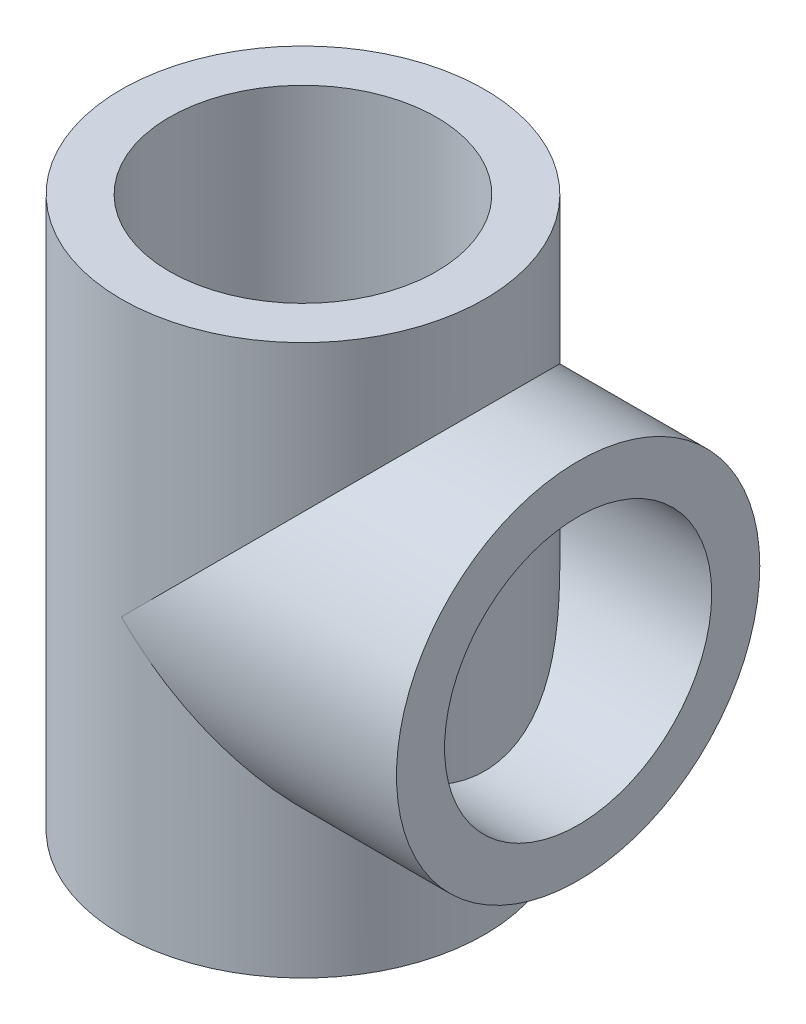
ISO-10303-21;
HEADER;
FILE_DESCRIPTION(('STEP AP214'),'2;1');
FILE_NAME('part.step','',(''),(''),'','','');
FILE_SCHEMA(('AUTOMOTIVE_DESIGN { 1 0 10303 214 1 1 1 1 }'));
ENDSEC;
DATA;
#1=APPLICATION_CONTEXT('core data for automotive mechanical design processes');
#2=APPLICATION_PROTOCOL_DEFINITION('international standard','automotive_design',2000,#1);
#3=PRODUCT_CONTEXT('',#1,'mechanical');
#4=PRODUCT('Part','Part','',(#3));
#5=PRODUCT_RELATED_PRODUCT_CATEGORY('part','',(#4));
#6=PRODUCT_DEFINITION_FORMATION('','',#4);
#7=PRODUCT_DEFINITION_CONTEXT('part definition',#1,'design');
#8=PRODUCT_DEFINITION('design','',#6,#7);
#9=PRODUCT_DEFINITION_SHAPE('','',#8);
#10=(LENGTH_UNIT() NAMED_UNIT(*) SI_UNIT(.MILLI.,.METRE.));
#11=(NAMED_UNIT(*) PLANE_ANGLE_UNIT() SI_UNIT($,.RADIAN.));
#12=(NAMED_UNIT(*) SI_UNIT($,.STERADIAN.) SOLID_ANGLE_UNIT());
#13=UNCERTAINTY_MEASURE_WITH_UNIT(LENGTH_MEASURE(1.E-05),#10,'distance_accuracy_value','');
#14=(GEOMETRIC_REPRESENTATION_CONTEXT(3) GLOBAL_UNCERTAINTY_ASSIGNED_CONTEXT((#13)) GLOBAL_UNIT_ASSIGNED_CONTEXT((#10,
#11,#12)) REPRESENTATION_CONTEXT('',''));
#15=CARTESIAN_POINT('',(0.,0.,0.));
#16=DIRECTION('',(0.,0.,1.));
#17=DIRECTION('',(1.,0.,0.));
#18=AXIS2_PLACEMENT_3D('',#15,#16,#17);
#19=CARTESIAN_POINT('',(0.,51.5,0.));
#20=DIRECTION('',(0.,1.,0.));
#21=DIRECTION('',(0.,0.,1.));
#22=AXIS2_PLACEMENT_3D('',#19,#20,#21);
#23=PLANE('',#22);
#24=CARTESIAN_POINT('',(0.,51.5,0.));
#25=DIRECTION('',(0.,1.,0.));
#26=DIRECTION('',(0.,0.,1.));
#27=AXIS2_PLACEMENT_3D('',#24,#25,#26);
#28=CIRCLE('',#27,34.);
#29=CARTESIAN_POINT('',(0.,51.5,34.));
#30=VERTEX_POINT('',#29);
#31=EDGE_CURVE('E45',#30,#30,#28,.T.);
#32=ORIENTED_EDGE('',*,*,#31,.T.);
#33=EDGE_LOOP('',(#32));
#34=FACE_BOUND('',#33,.T.);
#35=CARTESIAN_POINT('',(0.,51.5,0.));
#36=DIRECTION('',(0.,1.,0.));
#37=DIRECTION('',(0.,0.,1.));
#38=AXIS2_PLACEMENT_3D('',#35,#36,#37);
#39=CIRCLE('',#38,25.);
#40=CARTESIAN_POINT('',(0.,51.5,25.));
#41=VERTEX_POINT('',#40);
#42=EDGE_CURVE('E67',#41,#41,#39,.T.);
#43=ORIENTED_EDGE('',*,*,#42,.F.);
#44=EDGE_LOOP('',(#43));
#45=FACE_BOUND('',#44,.T.);
#46=ADVANCED_FACE('F32',(#34,#45),#23,.T.);
#47=CARTESIAN_POINT('',(0.,-51.5,0.));
#48=DIRECTION('',(0.,1.,0.));
#49=DIRECTION('',(0.,0.,1.));
#50=AXIS2_PLACEMENT_3D('',#47,#48,#49);
#51=PLANE('',#50);
#52=CARTESIAN_POINT('',(0.,-51.5,0.));
#53=DIRECTION('',(0.,1.,0.));
#54=DIRECTION('',(0.,0.,1.));
#55=AXIS2_PLACEMENT_3D('',#52,#53,#54);
#56=CIRCLE('',#55,34.);
#57=CARTESIAN_POINT('',(0.,-51.5,34.));
#58=VERTEX_POINT('',#57);
#59=EDGE_CURVE('E70',#58,#58,#56,.T.);
#60=ORIENTED_EDGE('',*,*,#59,.F.);
#61=EDGE_LOOP('',(#60));
#62=FACE_BOUND('',#61,.T.);
#63=CARTESIAN_POINT('',(0.,-51.5,0.));
#64=DIRECTION('',(0.,1.,0.));
#65=DIRECTION('',(0.,0.,1.));
#66=AXIS2_PLACEMENT_3D('',#63,#64,#65);
#67=CIRCLE('',#66,25.);
#68=CARTESIAN_POINT('',(0.,-51.5,25.));
#69=VERTEX_POINT('',#68);
#70=EDGE_CURVE('E56',#69,#69,#67,.T.);
#71=ORIENTED_EDGE('',*,*,#70,.T.);
#72=EDGE_LOOP('',(#71));
#73=FACE_BOUND('',#72,.T.);
#74=ADVANCED_FACE('F78',(#62,#73),#51,.F.);
#75=CARTESIAN_POINT('',(0.,51.5,0.));
#76=DIRECTION('',(0.,-1.,0.));
#77=DIRECTION('',(0.,0.,-1.));
#78=AXIS2_PLACEMENT_3D('',#75,#76,#77);
#79=CYLINDRICAL_SURFACE('',#78,34.);
#80=CARTESIAN_POINT('',(0.,0.,0.));
#81=DIRECTION('',(0.707106781186547,0.707106781186547,0.));
#82=DIRECTION('',(0.707106781186547,-0.707106781186547,0.));
#83=AXIS2_PLACEMENT_3D('',#80,#81,#82);
#84=ELLIPSE('',#83,48.0832611206852,34.);
#85=CARTESIAN_POINT('',(0.,0.,34.));
#86=VERTEX_POINT('',#85);
#87=CARTESIAN_POINT('',(0.,0.,-34.));
#88=VERTEX_POINT('',#87);
#89=EDGE_CURVE('E53',#86,#88,#84,.T.);
#90=ORIENTED_EDGE('',*,*,#89,.F.);
#91=CARTESIAN_POINT('',(0.,0.,0.));
#92=DIRECTION('',(0.707106781186547,-0.707106781186547,0.));
#93=DIRECTION('',(0.707106781186547,0.707106781186547,0.));
#94=AXIS2_PLACEMENT_3D('',#91,#92,#93);
#95=ELLIPSE('',#94,48.0832611206852,34.);
#96=EDGE_CURVE('E51',#88,#86,#95,.T.);
#97=ORIENTED_EDGE('',*,*,#96,.F.);
#98=EDGE_LOOP('',(#90,#97));
#99=FACE_BOUND('',#98,.T.);
#100=ORIENTED_EDGE('',*,*,#31,.F.);
#101=EDGE_LOOP('',(#100));
#102=FACE_BOUND('',#101,.T.);
#103=ORIENTED_EDGE('',*,*,#59,.T.);
#104=EDGE_LOOP('',(#103));
#105=FACE_BOUND('',#104,.T.);
#106=ADVANCED_FACE('F34',(#99,#102,#105),#79,.T.);
#107=CARTESIAN_POINT('',(0.,51.5,0.));
#108=DIRECTION('',(0.,-1.,0.));
#109=DIRECTION('',(0.,0.,-1.));
#110=AXIS2_PLACEMENT_3D('',#107,#108,#109);
#111=CYLINDRICAL_SURFACE('',#110,25.);
#112=ORIENTED_EDGE('',*,*,#42,.T.);
#113=EDGE_LOOP('',(#112));
#114=FACE_BOUND('',#113,.T.);
#115=ORIENTED_EDGE('',*,*,#70,.F.);
#116=EDGE_LOOP('',(#115));
#117=FACE_BOUND('',#116,.T.);
#118=ADVANCED_FACE('F83',(#114,#117),#111,.F.);
#119=CARTESIAN_POINT('',(-34.001,0.,0.));
#120=DIRECTION('',(1.,0.,0.));
#121=DIRECTION('',(0.,0.,-1.));
#122=AXIS2_PLACEMENT_3D('',#119,#120,#121);
#123=CYLINDRICAL_SURFACE('',#122,34.);
#124=CARTESIAN_POINT('',(51.5,0.,0.));
#125=DIRECTION('',(1.,0.,0.));
#126=DIRECTION('',(0.,0.,-1.));
#127=AXIS2_PLACEMENT_3D('',#124,#125,#126);
#128=CIRCLE('',#127,34.);
#129=CARTESIAN_POINT('',(51.5,0.,-34.));
#130=VERTEX_POINT('',#129);
#131=EDGE_CURVE('E59',#130,#130,#128,.T.);
#132=ORIENTED_EDGE('',*,*,#131,.F.);
#133=EDGE_LOOP('',(#132));
#134=FACE_BOUND('',#133,.T.);
#135=ORIENTED_EDGE('',*,*,#89,.T.);
#136=ORIENTED_EDGE('',*,*,#96,.T.);
#137=EDGE_LOOP('',(#135,#136));
#138=FACE_BOUND('',#137,.T.);
#139=ADVANCED_FACE('F54',(#134,#138),#123,.T.);
#140=CARTESIAN_POINT('',(51.5,0.,0.));
#141=DIRECTION('',(1.,0.,0.));
#142=DIRECTION('',(0.,0.,-1.));
#143=AXIS2_PLACEMENT_3D('',#140,#141,#142);
#144=PLANE('',#143);
#145=CARTESIAN_POINT('',(51.5,0.,0.));
#146=DIRECTION('',(1.,0.,0.));
#147=DIRECTION('',(0.,0.,-1.));
#148=AXIS2_PLACEMENT_3D('',#145,#146,#147);
#149=CIRCLE('',#148,25.);
#150=CARTESIAN_POINT('',(51.5,0.,-25.));
#151=VERTEX_POINT('',#150);
#152=EDGE_CURVE('E62',#151,#151,#149,.T.);
#153=ORIENTED_EDGE('',*,*,#152,.F.);
#154=EDGE_LOOP('',(#153));
#155=FACE_BOUND('',#154,.T.);
#156=ORIENTED_EDGE('',*,*,#131,.T.);
#157=EDGE_LOOP('',(#156));
#158=FACE_BOUND('',#157,.T.);
#159=ADVANCED_FACE('F91',(#155,#158),#144,.T.);
#160=CARTESIAN_POINT('',(-34.001,0.,0.));
#161=DIRECTION('',(1.,0.,0.));
#162=DIRECTION('',(0.,0.,-1.));
#163=AXIS2_PLACEMENT_3D('',#160,#161,#162);
#164=CYLINDRICAL_SURFACE('',#163,25.);
#165=ORIENTED_EDGE('',*,*,#152,.T.);
#166=EDGE_LOOP('',(#165));
#167=FACE_BOUND('',#166,.T.);
#168=CARTESIAN_POINT('',(23.0434372436058,0.,-25.));
#169=CARTESIAN_POINT('',(23.0434365851331,-0.294208786743109,-25.0000003320806));
#170=CARTESIAN_POINT('',(23.0490787477466,-0.588410640843061,-24.9948035072554));
#171=CARTESIAN_POINT('',(23.0715596193639,-1.17603923967423,-24.9740539603658));
#172=CARTESIAN_POINT('',(23.0883990467207,-1.46946593346292,-24.9585005738827));
#173=CARTESIAN_POINT('',(23.1330337162663,-2.05485622300453,-24.9171362976345));
#174=CARTESIAN_POINT('',(23.1608325464365,-2.34681930785506,-24.8913220485589));
#175=CARTESIAN_POINT('',(23.2269788461216,-2.92850493069961,-24.8296086969587));
#176=CARTESIAN_POINT('',(23.2653283038144,-3.21822703580976,-24.7937076936421));
#177=CARTESIAN_POINT('',(23.3956276803678,-4.08425087943115,-24.6710169081657));
#178=CARTESIAN_POINT('',(23.5027385058664,-4.65627076291798,-24.5693209414342));
#179=CARTESIAN_POINT('',(23.752004355155,-5.78454928016702,-24.3284221252543));
#180=CARTESIAN_POINT('',(23.8941695370775,-6.34080329307122,-24.1892084027349));
#181=CARTESIAN_POINT('',(24.1280749204997,-7.15757768793782,-23.9551233418574));
#182=CARTESIAN_POINT('',(24.2088792731225,-7.4251709772124,-23.8735116694988));
#183=CARTESIAN_POINT('',(24.3767919089928,-7.95557816683494,-23.7020341054773));
#184=CARTESIAN_POINT('',(24.4638978769865,-8.21839377857004,-23.6121712421208));
#185=CARTESIAN_POINT('',(24.7336668180133,-8.99962469443892,-23.3305222082008));
#186=CARTESIAN_POINT('',(24.9247839973228,-9.51083495963225,-23.1266724589127));
#187=CARTESIAN_POINT('',(25.3240904444169,-10.5128855393589,-22.6887247056389));
#188=CARTESIAN_POINT('',(25.5322748564202,-11.0037315882513,-22.454635294272));
#189=CARTESIAN_POINT('',(25.9610220133544,-11.964934513743,-21.9575294525089));
#190=CARTESIAN_POINT('',(26.1815856179339,-12.4352899633746,-21.6945110119733));
#191=CARTESIAN_POINT('',(26.6754683313408,-13.4466450211665,-21.0855876009936));
#192=CARTESIAN_POINT('',(26.9505640123992,-13.9831187849961,-20.7335960780642));
#193=CARTESIAN_POINT('',(27.5059651873455,-15.0257345610172,-19.9909226736626));
#194=CARTESIAN_POINT('',(27.7862711000226,-15.531874121067,-19.6002376710588));
#195=CARTESIAN_POINT('',(28.3467251950762,-16.5136134433482,-18.7805742969756));
#196=CARTESIAN_POINT('',(28.6268726766583,-16.9891718627402,-18.3515458855155));
#197=CARTESIAN_POINT('',(29.1813617488463,-17.9077043209249,-17.4563866522469));
#198=CARTESIAN_POINT('',(29.4557028810833,-18.3506757940005,-16.9902529149719));
#199=CARTESIAN_POINT('',(30.0454724520518,-19.2843338152721,-15.928153362088));
#200=CARTESIAN_POINT('',(30.3586247240195,-19.7677536990523,-15.3244829973088));
#201=CARTESIAN_POINT('',(30.9613747056909,-20.6815025363885,-14.0669727349089));
#202=CARTESIAN_POINT('',(31.2509674114695,-21.1118202213025,-13.41312223631));
#203=CARTESIAN_POINT('',(31.7980165390954,-21.9134558087114,-12.0589335628665));
#204=CARTESIAN_POINT('',(32.0555304328211,-22.2848795602659,-11.3586820719342));
#205=CARTESIAN_POINT('',(32.4120466825305,-22.7937558941551,-10.2763671311546));
#206=CARTESIAN_POINT('',(32.5259134294543,-22.9553202066663,-9.91032232871883));
#207=CARTESIAN_POINT('',(32.7428843089149,-23.2617324711228,-9.16804347578046));
#208=CARTESIAN_POINT('',(32.8459858452941,-23.4065763916331,-8.7918069948595));
#209=CARTESIAN_POINT('',(33.0808784353363,-23.7352629956,-7.87178021465565));
#210=CARTESIAN_POINT('',(33.2067991154883,-23.9103160635357,-7.32330295180682));
#211=CARTESIAN_POINT('',(33.4327516196458,-24.223141345838,-6.21073849318905));
#212=CARTESIAN_POINT('',(33.5327894087188,-24.3609221504433,-5.6466549273379));
#213=CARTESIAN_POINT('',(33.7049473719424,-24.5973585310408,-4.5065097510684));
#214=CARTESIAN_POINT('',(33.7770858959963,-24.6960398246115,-3.93045627715577));
#215=CARTESIAN_POINT('',(33.8919975551742,-24.852974848957,-2.76992765796601));
#216=CARTESIAN_POINT('',(33.9347696537531,-24.9112271527125,-2.18545221616246));
#217=CARTESIAN_POINT('',(33.9900619270024,-24.9864956940813,-1.01099215655088));
#218=CARTESIAN_POINT('',(34.0025087728251,-25.0034119782363,-0.420997641023792));
#219=CARTESIAN_POINT('',(33.996653403953,-24.9954485762181,0.758552460594944));
#220=CARTESIAN_POINT('',(33.9783513085277,-24.9705690521631,1.34810804838024));
#221=CARTESIAN_POINT('',(33.9114072253857,-24.8793989893293,2.52238111258916));
#222=CARTESIAN_POINT('',(33.8627588404687,-24.8130997189874,3.10709754254456));
#223=CARTESIAN_POINT('',(33.736194665601,-24.6400954772338,4.26728276258145));
#224=CARTESIAN_POINT('',(33.6582790014424,-24.5333906794871,4.84275159239847));
#225=CARTESIAN_POINT('',(33.47767777217,-24.2850146607734,5.96297007909016));
#226=CARTESIAN_POINT('',(33.3758325882267,-24.144526623153,6.50811939709243));
#227=CARTESIAN_POINT('',(33.1481370771857,-23.8287840823297,7.58306436987353));
#228=CARTESIAN_POINT('',(33.0222874146214,-23.65353054156,8.11286044921962));
#229=CARTESIAN_POINT('',(32.7487809026958,-23.2701673905688,9.15464001880102));
#230=CARTESIAN_POINT('',(32.6011223167147,-23.0620551637563,9.66662208651172));
#231=CARTESIAN_POINT('',(32.2864066002565,-22.6149785506853,10.6707472383685));
#232=CARTESIAN_POINT('',(32.1193483202114,-22.3760123360174,11.1628891445153));
#233=CARTESIAN_POINT('',(31.7490720723275,-21.8413545265688,12.1786625558453));
#234=CARTESIAN_POINT('',(31.5438978290794,-21.5423154955309,12.6998187732462));
#235=CARTESIAN_POINT('',(31.1162799908543,-20.91116356599,13.7142327066723));
#236=CARTESIAN_POINT('',(30.8938353261487,-20.5790486184063,14.2074886912829));
#237=CARTESIAN_POINT('',(30.43507198107,-19.8837104517921,15.1653751233287));
#238=CARTESIAN_POINT('',(30.1987427301521,-19.5204634323457,15.62998319443));
#239=CARTESIAN_POINT('',(29.7159863772863,-18.7649745828638,16.5293892495121));
#240=CARTESIAN_POINT('',(29.4695587930396,-18.3727313672422,16.9641858070308));
#241=CARTESIAN_POINT('',(28.9223119326658,-17.4827341652167,17.8840307157625));
#242=CARTESIAN_POINT('',(28.6201389296114,-16.9791875645369,18.3626840753722));
#243=CARTESIAN_POINT('',(28.0132113176773,-15.9348878476977,19.2759083505725));
#244=CARTESIAN_POINT('',(27.708456210314,-15.3941273968342,19.7104705339618));
#245=CARTESIAN_POINT('',(27.1034591321825,-14.2764988788964,20.5344538228946));
#246=CARTESIAN_POINT('',(26.8032187611367,-13.6996183705183,20.9238592413152));
#247=CARTESIAN_POINT('',(26.2154740768162,-12.5107190971429,21.6556923051669));
#248=CARTESIAN_POINT('',(25.9279666095552,-11.8987091210632,21.9981316288386));
#249=CARTESIAN_POINT('',(25.4333759801985,-10.7728996441618,22.5666561878841));
#250=CARTESIAN_POINT('',(25.2221223639501,-10.2656209369711,22.8020471144596));
#251=CARTESIAN_POINT('',(24.8186170302689,-9.22990673229119,23.2405896573819));
#252=CARTESIAN_POINT('',(24.6263646576656,-8.70147196515495,23.4437423854612));
#253=CARTESIAN_POINT('',(24.2670525480119,-7.6253846599187,23.815476334075));
#254=CARTESIAN_POINT('',(24.0999463233893,-7.07776994991722,23.9841215614923));
#255=CARTESIAN_POINT('',(23.7967468403818,-5.96420904706584,24.2849864057399));
#256=CARTESIAN_POINT('',(23.6606466591651,-5.39826697852544,24.4172141550128));
#257=CARTESIAN_POINT('',(23.4461674809374,-4.35168676300196,24.6230639723887));
#258=CARTESIAN_POINT('',(23.3618524854824,-3.87348454484588,24.702896056856));
#259=CARTESIAN_POINT('',(23.2214534105177,-2.90916893324928,24.8349239579871));
#260=CARTESIAN_POINT('',(23.1653659132281,-2.42305650493687,24.8871231204794));
#261=CARTESIAN_POINT('',(23.0836669758189,-1.44644519773405,24.9629215813603));
#262=CARTESIAN_POINT('',(23.0580299903697,-0.955950343897186,24.986544852742));
#263=CARTESIAN_POINT('',(23.0382212036617,0.0262332066964931,25.0048106604305));
#264=CARTESIAN_POINT('',(23.044049988068,0.517921925504186,24.9994526573157));
#265=CARTESIAN_POINT('',(23.0869090724305,1.49835779873127,24.9598769638218));
#266=CARTESIAN_POINT('',(23.1239145422358,1.9871069824059,24.9256822399469));
#267=CARTESIAN_POINT('',(23.2275681828424,2.95859324253019,24.8291170188785));
#268=CARTESIAN_POINT('',(23.2942163308072,3.4413303236112,24.7667465433914));
#269=CARTESIAN_POINT('',(23.4547271102803,4.39854936272489,24.6147913733637));
#270=CARTESIAN_POINT('',(23.5486265029757,4.87301924594331,24.5251699101372));
#271=CARTESIAN_POINT('',(23.7604125886389,5.81085551041086,24.3200429589065));
#272=CARTESIAN_POINT('',(23.8783026491077,6.27422032265561,24.2045338368953));
#273=CARTESIAN_POINT('',(24.1852643842073,7.36896543180645,23.8984661288859));
#274=CARTESIAN_POINT('',(24.3840566211407,7.99439389800757,23.6962870713928));
#275=CARTESIAN_POINT('',(24.8122479803728,9.21828709071655,23.2475475982459));
#276=CARTESIAN_POINT('',(25.0416595796333,9.81674069165265,23.0009690760567));
#277=CARTESIAN_POINT('',(25.5228610002288,10.9864019122896,22.4658238481008));
#278=CARTESIAN_POINT('',(25.7746860737701,11.5575643601046,22.1771905271066));
#279=CARTESIAN_POINT('',(26.2928228513898,12.6710444649899,21.5603735843938));
#280=CARTESIAN_POINT('',(26.5591330870634,13.2133650348662,21.2321939675188));
#281=CARTESIAN_POINT('',(27.1083882378479,14.2857814236657,20.5266057620719));
#282=CARTESIAN_POINT('',(27.3915927186803,14.8149261420419,20.1479551587951));
#283=CARTESIAN_POINT('',(27.9601363375292,15.8414583397582,19.3512358519928));
#284=CARTESIAN_POINT('',(28.2454755621596,16.3388445226499,18.9331655409973));
#285=CARTESIAN_POINT('',(28.8123514709984,17.3003532368461,18.0587845882495));
#286=CARTESIAN_POINT('',(29.0938907543306,17.7644995485775,17.6025018018187));
#287=CARTESIAN_POINT('',(29.6480480818752,18.658232065541,16.652200382994));
#288=CARTESIAN_POINT('',(29.9206664083076,19.0878193646967,16.1581829460104));
#289=CARTESIAN_POINT('',(30.4467771255839,19.902285494441,15.1431250807149));
#290=CARTESIAN_POINT('',(30.7005363431733,20.2878647126761,14.6227861761176));
#291=CARTESIAN_POINT('',(31.1898440011805,21.0209621790318,13.5477803931382));
#292=CARTESIAN_POINT('',(31.4253926850172,21.36848093593,12.9931139737881));
#293=CARTESIAN_POINT('',(31.8736096679624,22.0223441182521,11.8511268300278));
#294=CARTESIAN_POINT('',(32.0862780698083,22.3286887285583,11.2638062522597));
#295=CARTESIAN_POINT('',(32.4841476626305,22.8967452579605,10.05895437421));
#296=CARTESIAN_POINT('',(32.6693491566315,23.1584576694594,9.44142340732009));
#297=CARTESIAN_POINT('',(33.0094336707806,23.6357996293597,8.17384040517495));
#298=CARTESIAN_POINT('',(33.1640277008173,23.8509915389941,7.52354498711181));
#299=CARTESIAN_POINT('',(33.4366976598236,24.2286987528919,6.2002803336297));
#300=CARTESIAN_POINT('',(33.5547730143088,24.3912132284756,5.52731074170238));
#301=CARTESIAN_POINT('',(33.7509060538759,24.6603355220237,4.16524133510242));
#302=CARTESIAN_POINT('',(33.8290049181247,24.7670008719172,3.47615888649306));
#303=CARTESIAN_POINT('',(33.9429604370228,24.9224274613367,2.08807619127617));
#304=CARTESIAN_POINT('',(33.9788246676417,24.9711990857435,1.38907774615487));
#305=CARTESIAN_POINT('',(34.0050623856719,25.0068854025917,0.0949261086384237));
#306=CARTESIAN_POINT('',(34.0015104047181,25.0020599545338,-0.499897793708451));
#307=CARTESIAN_POINT('',(33.9633263805391,24.9501075584209,-1.68664303253791));
#308=CARTESIAN_POINT('',(33.9286980747887,24.9029856972535,-2.27856470945693));
#309=CARTESIAN_POINT('',(33.8291511007324,24.7671876953196,-3.45500967267773));
#310=CARTESIAN_POINT('',(33.7642326061652,24.6785117928992,-4.03953300139528));
#311=CARTESIAN_POINT('',(33.6055351507123,24.460938830963,-5.19704603992551));
#312=CARTESIAN_POINT('',(33.5117554397149,24.332040726059,-5.77003544955578));
#313=CARTESIAN_POINT('',(33.3006870552818,24.0404978000752,-6.88294255302966));
#314=CARTESIAN_POINT('',(33.1842335379379,23.8790461353779,-7.42333329395328));
#315=CARTESIAN_POINT('',(32.9282471862486,23.5220098392108,-8.48703730175333));
#316=CARTESIAN_POINT('',(32.7887151950383,23.3264264546742,-9.01035119166923));
#317=CARTESIAN_POINT('',(32.4889486895394,22.903146356362,-10.0376565201536));
#318=CARTESIAN_POINT('',(32.3287142128082,22.6754497008446,-10.5416479937736));
#319=CARTESIAN_POINT('',(31.990055350942,22.1899503106701,-11.5286008001303));
#320=CARTESIAN_POINT('',(31.8116286676359,21.9321437717148,-12.0115594648251));
#321=CARTESIAN_POINT('',(31.4153920207282,21.3536136456727,-13.0153869516086));
#322=CARTESIAN_POINT('',(31.1954630786159,21.0290599681158,-13.533212739366));
#323=CARTESIAN_POINT('',(30.7395939004561,20.3466730526168,-14.5389926782789));
#324=CARTESIAN_POINT('',(30.5036525061502,19.9888374065336,-15.0269446636511));
#325=CARTESIAN_POINT('',(30.0193423202004,19.2416724428837,-15.9725246477476));
#326=CARTESIAN_POINT('',(29.7709602710201,18.8523092429973,-16.4301190346808));
#327=CARTESIAN_POINT('',(29.2659308425694,18.0442287024019,-17.3137024390013));
#328=CARTESIAN_POINT('',(29.0092831024147,17.6255100790783,-17.7396900737317));
#329=CARTESIAN_POINT('',(28.4415980539296,16.6762148718001,-18.6389441972268));
#330=CARTESIAN_POINT('',(28.1296582476975,16.1396854159557,-19.1053767413717));
#331=CARTESIAN_POINT('',(27.5070566603415,15.0283117246049,-19.9913744575184));
#332=CARTESIAN_POINT('',(27.1963952054191,14.4534582842713,-20.4109283047599));
#333=CARTESIAN_POINT('',(26.5846672818982,13.2666189565806,-21.2015375889917));
#334=CARTESIAN_POINT('',(26.2835991171398,12.6546396895141,-21.5726016356956));
#335=CARTESIAN_POINT('',(25.7004993327493,11.3941958674327,-22.264066902879));
#336=CARTESIAN_POINT('',(25.4184602453741,10.745745810312,-22.5844880646377));
#337=CARTESIAN_POINT('',(24.9594296359861,9.60029414458569,-23.0891421290402));
#338=CARTESIAN_POINT('',(24.7751783048144,9.11189182209371,-23.2863526203009));
#339=CARTESIAN_POINT('',(24.4268543874934,8.11715403204439,-23.6514783794429));
#340=CARTESIAN_POINT('',(24.2627813741269,7.61081894445362,-23.8193942675837));
#341=CARTESIAN_POINT('',(23.9602235063429,6.58277825880653,-24.1237157726168));
#342=CARTESIAN_POINT('',(23.8216736482053,6.0611157440309,-24.2602016654039));
#343=CARTESIAN_POINT('',(23.5747544465012,5.00330454679634,-24.5002187991074));
#344=CARTESIAN_POINT('',(23.4663731901754,4.46716167424311,-24.6037630500962));
#345=CARTESIAN_POINT('',(23.3213900240458,3.60387457233956,-24.7410230203588));
#346=CARTESIAN_POINT('',(23.2735180037627,3.28035238960057,-24.7860150039801));
#347=CARTESIAN_POINT('',(23.1908144954976,2.63016320683634,-24.8634140501431));
#348=CARTESIAN_POINT('',(23.1559812782474,2.30349662973419,-24.8958227815568));
#349=CARTESIAN_POINT('',(23.0999811240507,1.64796610751259,-24.9477920776915));
#350=CARTESIAN_POINT('',(23.0788146115323,1.31910209447078,-24.9673522433924));
#351=CARTESIAN_POINT('',(23.0505411467979,0.66015601510651,-24.9934577714143));
#352=CARTESIAN_POINT('',(23.0434379823482,0.330073644612961,-24.9999996274379));
#353=CARTESIAN_POINT('',(23.0434372436058,0.,-25.));
#354=B_SPLINE_CURVE_WITH_KNOTS('',3,(#168,#169,#170,#171,#172,#173,#174,#175,#176,#177,#178,
#179,#180,#181,#182,#183,#184,#185,#186,#187,#188,#189,#190,#191,#192,#193,#194,#195,#196,#197,
#198,#199,#200,#201,#202,#203,#204,#205,#206,#207,#208,#209,#210,#211,#212,#213,#214,#215,#216,
#217,#218,#219,#220,#221,#222,#223,#224,#225,#226,#227,#228,#229,#230,#231,#232,#233,#234,#235,
#236,#237,#238,#239,#240,#241,#242,#243,#244,#245,#246,#247,#248,#249,#250,#251,#252,#253,#254,
#255,#256,#257,#258,#259,#260,#261,#262,#263,#264,#265,#266,#267,#268,#269,#270,#271,#272,#273,
#274,#275,#276,#277,#278,#279,#280,#281,#282,#283,#284,#285,#286,#287,#288,#289,#290,#291,#292,
#293,#294,#295,#296,#297,#298,#299,#300,#301,#302,#303,#304,#305,#306,#307,#308,#309,#310,#311,
#312,#313,#314,#315,#316,#317,#318,#319,#320,#321,#322,#323,#324,#325,#326,#327,#328,#329,#330,
#331,#332,#333,#334,#335,#336,#337,#338,#339,#340,#341,#342,#343,#344,#345,#346,#347,#348,#349,
#350,#351,#352,#353),.UNSPECIFIED.,.T.,.F.,(4,2,2,2,2,2,2,2,2,2,2,2,2,2,2,2,2,2,2,2,2,2,2,2,2,2,
2,2,2,2,2,2,2,2,2,2,2,2,2,2,2,2,2,2,2,2,2,2,2,2,2,2,2,2,2,2,2,2,2,2,2,2,2,2,2,2,2,2,2,2,2,2,2,2,
2,2,2,2,2,2,2,2,2,2,2,2,2,2,2,2,2,2,4),(0.,0.882514394473538,1.76508541154288,2.64794561240634,
3.5309722950134,5.30044793536124,7.07043694230926,7.94383714707413,8.81691807293482,
10.5630447441767,12.3086763393533,14.0544293068121,16.1469494113145,18.239638442424,
20.3350995654934,22.430725497471,24.9303892357672,27.4305825105809,29.9262300114024,
31.173728575911,32.4215272979165,34.1875978780396,35.9532610796837,37.7177609863694,
39.4823231713163,41.2511479902475,43.0199659482486,44.7891569109416,46.5583402696555,
48.2728201893594,49.9872526527577,51.7018217081373,53.4164924156661,55.3194241880497,
57.2224739220639,59.126991738482,61.0316006213702,63.3021390096986,65.5731262010866,
67.84489996794,70.1161078242876,71.9081488971427,73.7001281581266,75.4887527838053,
77.2769776645436,78.7517543031859,80.2263523331768,81.6997124280371,83.1730999463023,
84.6453151177533,86.1175291550311,87.5917384741633,89.0661548667285,91.1231254051299,
93.1809367039393,95.242043766196,97.3029422757843,99.4299900855242,101.557124670276,
103.682721937713,105.808251895453,107.89294544615,109.977611126075,112.062267445015,
114.146900763579,116.250365305896,118.353862936649,120.455189404292,122.556138882478,
124.33843955049,126.120525894211,127.902602016349,129.684724459088,131.410614896682,
133.136442295554,134.862266563561,136.588309120937,138.53493721001,140.481706258513,
142.430595977181,144.379570901024,146.706210113135,149.033410175371,151.360196463388,
153.686064254809,155.358865488971,157.031631300333,158.700076074817,160.367861088263,
161.357790445478,162.347588466994,163.337417225844,164.327512544994),.UNSPECIFIED.);
#355=CARTESIAN_POINT('',(23.0434372436058,0.,-25.));
#356=VERTEX_POINT('',#355);
#357=EDGE_CURVE('E11',#356,#356,#354,.T.);
#358=ORIENTED_EDGE('',*,*,#357,.T.);
#359=EDGE_LOOP('',(#358));
#360=FACE_BOUND('',#359,.T.);
#361=ADVANCED_FACE('F129',(#167,#360),#164,.F.);
#362=ORIENTED_EDGE('',*,*,#357,.F.);
#363=EDGE_LOOP('',(#362));
#364=FACE_BOUND('',#363,.T.);
#365=ADVANCED_FACE('F94',(#364),#79,.T.);
#366=CLOSED_SHELL('',(#46,#74,#106,#118,#139,#159,#361,#365));
#367=MANIFOLD_SOLID_BREP('B2',#366);
#368=ADVANCED_BREP_SHAPE_REPRESENTATION('',(#18,#367),#14);
#369=SHAPE_DEFINITION_REPRESENTATION(#9,#368);
ENDSEC;
END-ISO-10303-21;
